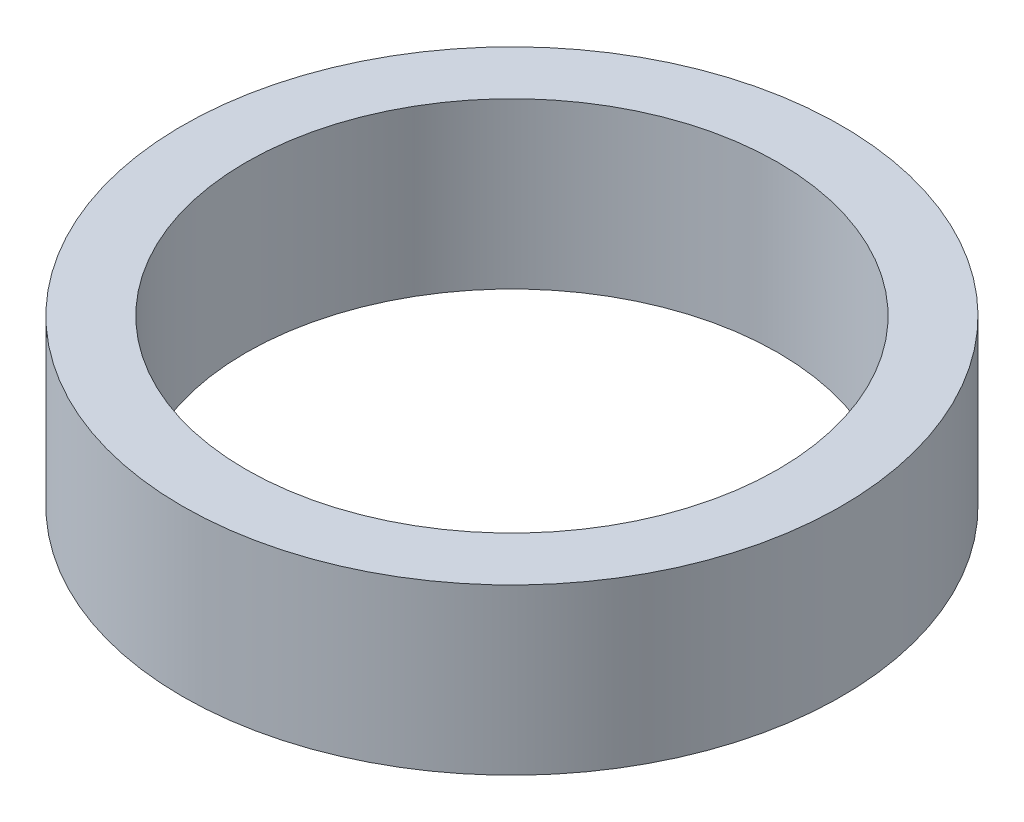
ISO-10303-21;
HEADER;
FILE_DESCRIPTION(('STEP AP214'),'2;1');
FILE_NAME('part.step','',(''),(''),'','','');
FILE_SCHEMA(('AUTOMOTIVE_DESIGN { 1 0 10303 214 1 1 1 1 }'));
ENDSEC;
DATA;
#1=APPLICATION_CONTEXT('core data for automotive mechanical design processes');
#2=APPLICATION_PROTOCOL_DEFINITION('international standard','automotive_design',2000,#1);
#3=PRODUCT_CONTEXT('',#1,'mechanical');
#4=PRODUCT('Part','Part','',(#3));
#5=PRODUCT_RELATED_PRODUCT_CATEGORY('part','',(#4));
#6=PRODUCT_DEFINITION_FORMATION('','',#4);
#7=PRODUCT_DEFINITION_CONTEXT('part definition',#1,'design');
#8=PRODUCT_DEFINITION('design','',#6,#7);
#9=PRODUCT_DEFINITION_SHAPE('','',#8);
#10=(LENGTH_UNIT() NAMED_UNIT(*) SI_UNIT(.MILLI.,.METRE.));
#11=(NAMED_UNIT(*) PLANE_ANGLE_UNIT() SI_UNIT($,.RADIAN.));
#12=(NAMED_UNIT(*) SI_UNIT($,.STERADIAN.) SOLID_ANGLE_UNIT());
#13=UNCERTAINTY_MEASURE_WITH_UNIT(LENGTH_MEASURE(1.E-05),#10,'distance_accuracy_value','');
#14=(GEOMETRIC_REPRESENTATION_CONTEXT(3) GLOBAL_UNCERTAINTY_ASSIGNED_CONTEXT((#13)) GLOBAL_UNIT_ASSIGNED_CONTEXT((#10,
#11,#12)) REPRESENTATION_CONTEXT('',''));
#15=CARTESIAN_POINT('',(0.,0.,0.));
#16=DIRECTION('',(0.,0.,1.));
#17=DIRECTION('',(1.,0.,0.));
#18=AXIS2_PLACEMENT_3D('',#15,#16,#17);
#19=CARTESIAN_POINT('',(20.5,0.,0.));
#20=DIRECTION('',(0.,1.,0.));
#21=DIRECTION('',(0.,0.,1.));
#22=AXIS2_PLACEMENT_3D('',#19,#20,#21);
#23=PLANE('',#22);
#24=CARTESIAN_POINT('',(0.,0.,0.));
#25=DIRECTION('',(0.,1.,0.));
#26=DIRECTION('',(0.,0.,1.));
#27=AXIS2_PLACEMENT_3D('',#24,#25,#26);
#28=CIRCLE('',#27,25.4);
#29=CARTESIAN_POINT('',(0.,0.,25.4));
#30=VERTEX_POINT('',#29);
#31=EDGE_CURVE('E10',#30,#30,#28,.T.);
#32=ORIENTED_EDGE('',*,*,#31,.F.);
#33=EDGE_LOOP('',(#32));
#34=FACE_BOUND('',#33,.T.);
#35=CARTESIAN_POINT('',(0.,0.,0.));
#36=DIRECTION('',(0.,1.,0.));
#37=DIRECTION('',(0.,0.,1.));
#38=AXIS2_PLACEMENT_3D('',#35,#36,#37);
#39=CIRCLE('',#38,20.5);
#40=CARTESIAN_POINT('',(0.,0.,20.5));
#41=VERTEX_POINT('',#40);
#42=EDGE_CURVE('E51',#41,#41,#39,.T.);
#43=ORIENTED_EDGE('',*,*,#42,.T.);
#44=EDGE_LOOP('',(#43));
#45=FACE_BOUND('',#44,.T.);
#46=ADVANCED_FACE('F37',(#34,#45),#23,.F.);
#47=CARTESIAN_POINT('',(0.,161.376166943427,0.));
#48=DIRECTION('',(0.,1.,0.));
#49=DIRECTION('',(0.,0.,1.));
#50=AXIS2_PLACEMENT_3D('',#47,#48,#49);
#51=CYLINDRICAL_SURFACE('',#50,25.4);
#52=CARTESIAN_POINT('',(0.,12.7,0.));
#53=DIRECTION('',(0.,1.,0.));
#54=DIRECTION('',(0.,0.,1.));
#55=AXIS2_PLACEMENT_3D('',#52,#53,#54);
#56=CIRCLE('',#55,25.4);
#57=CARTESIAN_POINT('',(0.,12.7,25.4));
#58=VERTEX_POINT('',#57);
#59=EDGE_CURVE('E43',#58,#58,#56,.T.);
#60=ORIENTED_EDGE('',*,*,#59,.F.);
#61=EDGE_LOOP('',(#60));
#62=FACE_BOUND('',#61,.T.);
#63=ORIENTED_EDGE('',*,*,#31,.T.);
#64=EDGE_LOOP('',(#63));
#65=FACE_BOUND('',#64,.T.);
#66=ADVANCED_FACE('F66',(#62,#65),#51,.T.);
#67=CARTESIAN_POINT('',(20.5,12.7,0.));
#68=DIRECTION('',(0.,-1.,0.));
#69=DIRECTION('',(0.,0.,-1.));
#70=AXIS2_PLACEMENT_3D('',#67,#68,#69);
#71=PLANE('',#70);
#72=CARTESIAN_POINT('',(0.,12.7,0.));
#73=DIRECTION('',(0.,1.,0.));
#74=DIRECTION('',(0.,0.,1.));
#75=AXIS2_PLACEMENT_3D('',#72,#73,#74);
#76=CIRCLE('',#75,20.5);
#77=CARTESIAN_POINT('',(0.,12.7,20.5));
#78=VERTEX_POINT('',#77);
#79=EDGE_CURVE('E47',#78,#78,#76,.T.);
#80=ORIENTED_EDGE('',*,*,#79,.F.);
#81=EDGE_LOOP('',(#80));
#82=FACE_BOUND('',#81,.T.);
#83=ORIENTED_EDGE('',*,*,#59,.T.);
#84=EDGE_LOOP('',(#83));
#85=FACE_BOUND('',#84,.T.);
#86=ADVANCED_FACE('F61',(#82,#85),#71,.F.);
#87=CARTESIAN_POINT('',(0.,161.376166943427,0.));
#88=DIRECTION('',(0.,1.,0.));
#89=DIRECTION('',(0.,0.,1.));
#90=AXIS2_PLACEMENT_3D('',#87,#88,#89);
#91=CYLINDRICAL_SURFACE('',#90,20.5);
#92=ORIENTED_EDGE('',*,*,#42,.F.);
#93=EDGE_LOOP('',(#92));
#94=FACE_BOUND('',#93,.T.);
#95=ORIENTED_EDGE('',*,*,#79,.T.);
#96=EDGE_LOOP('',(#95));
#97=FACE_BOUND('',#96,.T.);
#98=ADVANCED_FACE('F58',(#94,#97),#91,.F.);
#99=CLOSED_SHELL('',(#46,#66,#86,#98));
#100=MANIFOLD_SOLID_BREP('B2',#99);
#101=ADVANCED_BREP_SHAPE_REPRESENTATION('',(#18,#100),#14);
#102=SHAPE_DEFINITION_REPRESENTATION(#9,#101);
ENDSEC;
END-ISO-10303-21;
